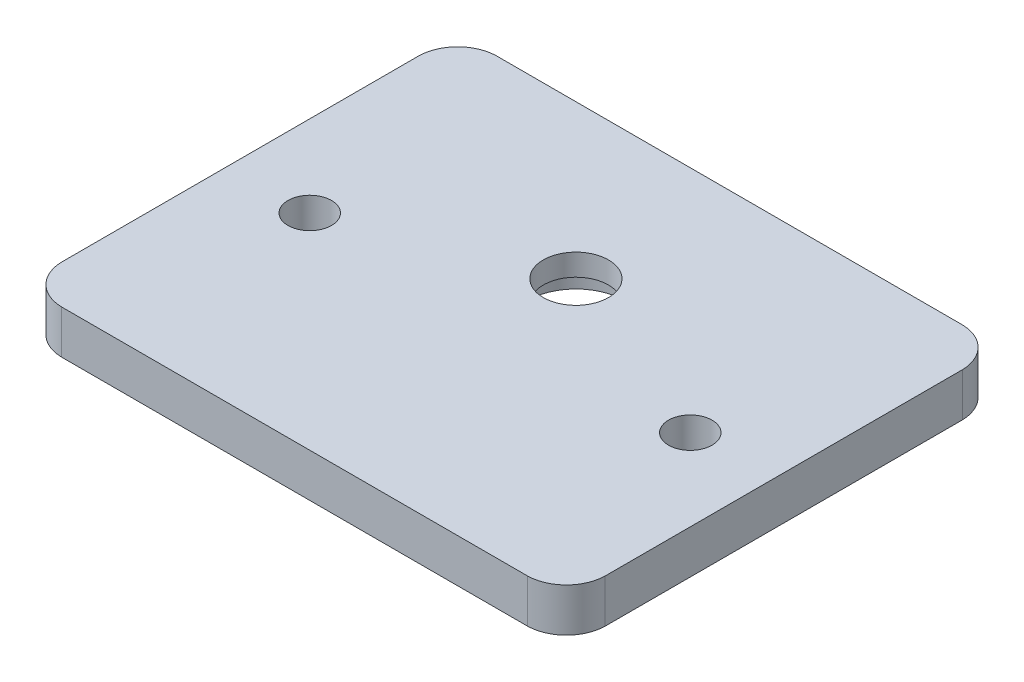
ISO-10303-21;
HEADER;
FILE_DESCRIPTION(('STEP AP214'),'2;1');
FILE_NAME('part.step','',(''),(''),'','','');
FILE_SCHEMA(('AUTOMOTIVE_DESIGN { 1 0 10303 214 1 1 1 1 }'));
ENDSEC;
DATA;
#1=APPLICATION_CONTEXT('core data for automotive mechanical design processes');
#2=APPLICATION_PROTOCOL_DEFINITION('international standard','automotive_design',2000,#1);
#3=PRODUCT_CONTEXT('',#1,'mechanical');
#4=PRODUCT('Part','Part','',(#3));
#5=PRODUCT_RELATED_PRODUCT_CATEGORY('part','',(#4));
#6=PRODUCT_DEFINITION_FORMATION('','',#4);
#7=PRODUCT_DEFINITION_CONTEXT('part definition',#1,'design');
#8=PRODUCT_DEFINITION('design','',#6,#7);
#9=PRODUCT_DEFINITION_SHAPE('','',#8);
#10=(LENGTH_UNIT() NAMED_UNIT(*) SI_UNIT(.MILLI.,.METRE.));
#11=(NAMED_UNIT(*) PLANE_ANGLE_UNIT() SI_UNIT($,.RADIAN.));
#12=(NAMED_UNIT(*) SI_UNIT($,.STERADIAN.) SOLID_ANGLE_UNIT());
#13=UNCERTAINTY_MEASURE_WITH_UNIT(LENGTH_MEASURE(1.E-05),#10,'distance_accuracy_value','');
#14=(GEOMETRIC_REPRESENTATION_CONTEXT(3) GLOBAL_UNCERTAINTY_ASSIGNED_CONTEXT((#13)) GLOBAL_UNIT_ASSIGNED_CONTEXT((#10,
#11,#12)) REPRESENTATION_CONTEXT('',''));
#15=CARTESIAN_POINT('',(0.,0.,0.));
#16=DIRECTION('',(0.,0.,1.));
#17=DIRECTION('',(1.,0.,0.));
#18=AXIS2_PLACEMENT_3D('',#15,#16,#17);
#19=CARTESIAN_POINT('',(21.3619626282644,4.,16.3619626282645));
#20=DIRECTION('',(0.,-1.,0.));
#21=DIRECTION('',(0.,0.,-1.));
#22=AXIS2_PLACEMENT_3D('',#19,#20,#21);
#23=CYLINDRICAL_SURFACE('',#22,3.63903046216359);
#24=CARTESIAN_POINT('',(21.3619626282644,0.,16.3619626282645));
#25=DIRECTION('',(0.,1.,0.));
#26=DIRECTION('',(0.,0.,1.));
#27=AXIS2_PLACEMENT_3D('',#24,#25,#26);
#28=CIRCLE('',#27,3.63903046216359);
#29=CARTESIAN_POINT('',(25.,0.,16.446973135908));
#30=VERTEX_POINT('',#29);
#31=CARTESIAN_POINT('',(21.4469731359103,0.,20.));
#32=VERTEX_POINT('',#31);
#33=EDGE_CURVE('E158',#30,#32,#28,.F.);
#34=ORIENTED_EDGE('',*,*,#33,.F.);
#35=DIRECTION('',(0.,-1.,0.));
#36=VECTOR('',#35,1.);
#37=CARTESIAN_POINT('',(25.,4.,16.446973135908));
#38=LINE('',#37,#36);
#39=CARTESIAN_POINT('',(25.,4.,16.446973135908));
#40=VERTEX_POINT('',#39);
#41=EDGE_CURVE('E11',#40,#30,#38,.T.);
#42=ORIENTED_EDGE('',*,*,#41,.F.);
#43=CARTESIAN_POINT('',(21.3619626282644,4.,16.3619626282645));
#44=DIRECTION('',(0.,1.,0.));
#45=DIRECTION('',(0.,0.,1.));
#46=AXIS2_PLACEMENT_3D('',#43,#44,#45);
#47=CIRCLE('',#46,3.63903046216359);
#48=CARTESIAN_POINT('',(21.4469731359103,4.,20.));
#49=VERTEX_POINT('',#48);
#50=EDGE_CURVE('E249',#40,#49,#47,.F.);
#51=ORIENTED_EDGE('',*,*,#50,.T.);
#52=DIRECTION('',(0.,-1.,0.));
#53=VECTOR('',#52,1.);
#54=CARTESIAN_POINT('',(21.4469731359103,4.,20.));
#55=LINE('',#54,#53);
#56=EDGE_CURVE('E87',#49,#32,#55,.T.);
#57=ORIENTED_EDGE('',*,*,#56,.T.);
#58=EDGE_LOOP('',(#34,#42,#51,#57));
#59=FACE_BOUND('',#58,.T.);
#60=ADVANCED_FACE('F35',(#59),#23,.T.);
#61=CARTESIAN_POINT('',(25.,4.,0.));
#62=DIRECTION('',(1.,0.,0.));
#63=DIRECTION('',(0.,0.,-1.));
#64=AXIS2_PLACEMENT_3D('',#61,#62,#63);
#65=PLANE('',#64);
#66=DIRECTION('',(0.,0.,1.));
#67=VECTOR('',#66,1.);
#68=CARTESIAN_POINT('',(25.,0.,0.));
#69=LINE('',#68,#67);
#70=CARTESIAN_POINT('',(25.,0.,-16.4469731359106));
#71=VERTEX_POINT('',#70);
#72=EDGE_CURVE('E152',#71,#30,#69,.T.);
#73=ORIENTED_EDGE('',*,*,#72,.F.);
#74=DIRECTION('',(0.,-1.,0.));
#75=VECTOR('',#74,1.);
#76=CARTESIAN_POINT('',(25.,4.,-16.4469731359106));
#77=LINE('',#76,#75);
#78=CARTESIAN_POINT('',(25.,4.,-16.4469731359106));
#79=VERTEX_POINT('',#78);
#80=EDGE_CURVE('E45',#79,#71,#77,.T.);
#81=ORIENTED_EDGE('',*,*,#80,.F.);
#82=DIRECTION('',(0.,0.,1.));
#83=VECTOR('',#82,1.);
#84=CARTESIAN_POINT('',(25.,4.,0.));
#85=LINE('',#84,#83);
#86=EDGE_CURVE('E251',#79,#40,#85,.T.);
#87=ORIENTED_EDGE('',*,*,#86,.T.);
#88=ORIENTED_EDGE('',*,*,#41,.T.);
#89=EDGE_LOOP('',(#73,#81,#87,#88));
#90=FACE_BOUND('',#89,.T.);
#91=ADVANCED_FACE('F157',(#90),#65,.T.);
#92=CARTESIAN_POINT('',(21.3619626282645,4.,-16.3619626282644));
#93=DIRECTION('',(0.,-1.,0.));
#94=DIRECTION('',(0.,0.,-1.));
#95=AXIS2_PLACEMENT_3D('',#92,#93,#94);
#96=CYLINDRICAL_SURFACE('',#95,3.63903046216359);
#97=CARTESIAN_POINT('',(21.3619626282645,0.,-16.3619626282644));
#98=DIRECTION('',(0.,1.,0.));
#99=DIRECTION('',(0.,0.,1.));
#100=AXIS2_PLACEMENT_3D('',#97,#98,#99);
#101=CIRCLE('',#100,3.63903046216359);
#102=CARTESIAN_POINT('',(21.446973135908,0.,-20.));
#103=VERTEX_POINT('',#102);
#104=EDGE_CURVE('E143',#71,#103,#101,.T.);
#105=ORIENTED_EDGE('',*,*,#104,.T.);
#106=DIRECTION('',(0.,-1.,0.));
#107=VECTOR('',#106,1.);
#108=CARTESIAN_POINT('',(21.446973135908,4.,-20.));
#109=LINE('',#108,#107);
#110=CARTESIAN_POINT('',(21.446973135908,4.,-20.));
#111=VERTEX_POINT('',#110);
#112=EDGE_CURVE('E135',#111,#103,#109,.T.);
#113=ORIENTED_EDGE('',*,*,#112,.F.);
#114=CARTESIAN_POINT('',(21.3619626282645,4.,-16.3619626282644));
#115=DIRECTION('',(0.,1.,0.));
#116=DIRECTION('',(0.,0.,1.));
#117=AXIS2_PLACEMENT_3D('',#114,#115,#116);
#118=CIRCLE('',#117,3.63903046216359);
#119=EDGE_CURVE('E145',#79,#111,#118,.T.);
#120=ORIENTED_EDGE('',*,*,#119,.F.);
#121=ORIENTED_EDGE('',*,*,#80,.T.);
#122=EDGE_LOOP('',(#105,#113,#120,#121));
#123=FACE_BOUND('',#122,.T.);
#124=ADVANCED_FACE('F141',(#123),#96,.T.);
#125=CARTESIAN_POINT('',(0.,4.,-20.));
#126=DIRECTION('',(0.,0.,-1.));
#127=DIRECTION('',(-1.,0.,0.));
#128=AXIS2_PLACEMENT_3D('',#125,#126,#127);
#129=PLANE('',#128);
#130=DIRECTION('',(1.,0.,0.));
#131=VECTOR('',#130,1.);
#132=CARTESIAN_POINT('',(0.,0.,-20.));
#133=LINE('',#132,#131);
#134=CARTESIAN_POINT('',(-21.4469731359094,0.,-20.));
#135=VERTEX_POINT('',#134);
#136=EDGE_CURVE('E155',#135,#103,#133,.T.);
#137=ORIENTED_EDGE('',*,*,#136,.F.);
#138=DIRECTION('',(0.,-1.,0.));
#139=VECTOR('',#138,1.);
#140=CARTESIAN_POINT('',(-21.4469731359094,4.,-20.));
#141=LINE('',#140,#139);
#142=CARTESIAN_POINT('',(-21.4469731359094,4.,-20.));
#143=VERTEX_POINT('',#142);
#144=EDGE_CURVE('E129',#143,#135,#141,.T.);
#145=ORIENTED_EDGE('',*,*,#144,.F.);
#146=DIRECTION('',(1.,0.,0.));
#147=VECTOR('',#146,1.);
#148=CARTESIAN_POINT('',(0.,4.,-20.));
#149=LINE('',#148,#147);
#150=EDGE_CURVE('E254',#143,#111,#149,.T.);
#151=ORIENTED_EDGE('',*,*,#150,.T.);
#152=ORIENTED_EDGE('',*,*,#112,.T.);
#153=EDGE_LOOP('',(#137,#145,#151,#152));
#154=FACE_BOUND('',#153,.T.);
#155=ADVANCED_FACE('F200',(#154),#129,.T.);
#156=CARTESIAN_POINT('',(-21.3619626282644,4.,-16.3619626282644));
#157=DIRECTION('',(0.,-1.,0.));
#158=DIRECTION('',(0.,0.,-1.));
#159=AXIS2_PLACEMENT_3D('',#156,#157,#158);
#160=CYLINDRICAL_SURFACE('',#159,3.63903046216359);
#161=CARTESIAN_POINT('',(-21.3619626282644,0.,-16.3619626282644));
#162=DIRECTION('',(0.,1.,0.));
#163=DIRECTION('',(0.,0.,1.));
#164=AXIS2_PLACEMENT_3D('',#161,#162,#163);
#165=CIRCLE('',#164,3.63903046216359);
#166=CARTESIAN_POINT('',(-25.,0.,-16.4469731359086));
#167=VERTEX_POINT('',#166);
#168=EDGE_CURVE('E165',#167,#135,#165,.F.);
#169=ORIENTED_EDGE('',*,*,#168,.F.);
#170=DIRECTION('',(0.,-1.,0.));
#171=VECTOR('',#170,1.);
#172=CARTESIAN_POINT('',(-25.,4.,-16.4469731359086));
#173=LINE('',#172,#171);
#174=CARTESIAN_POINT('',(-25.,4.,-16.4469731359086));
#175=VERTEX_POINT('',#174);
#176=EDGE_CURVE('E127',#175,#167,#173,.T.);
#177=ORIENTED_EDGE('',*,*,#176,.F.);
#178=CARTESIAN_POINT('',(-21.3619626282644,4.,-16.3619626282644));
#179=DIRECTION('',(0.,1.,0.));
#180=DIRECTION('',(0.,0.,1.));
#181=AXIS2_PLACEMENT_3D('',#178,#179,#180);
#182=CIRCLE('',#181,3.63903046216359);
#183=EDGE_CURVE('E121',#175,#143,#182,.F.);
#184=ORIENTED_EDGE('',*,*,#183,.T.);
#185=ORIENTED_EDGE('',*,*,#144,.T.);
#186=EDGE_LOOP('',(#169,#177,#184,#185));
#187=FACE_BOUND('',#186,.T.);
#188=ADVANCED_FACE('F203',(#187),#160,.T.);
#189=CARTESIAN_POINT('',(-25.,4.,0.));
#190=DIRECTION('',(1.,0.,0.));
#191=DIRECTION('',(0.,0.,-1.));
#192=AXIS2_PLACEMENT_3D('',#189,#190,#191);
#193=PLANE('',#192);
#194=DIRECTION('',(0.,0.,1.));
#195=VECTOR('',#194,1.);
#196=CARTESIAN_POINT('',(-25.,0.,0.));
#197=LINE('',#196,#195);
#198=CARTESIAN_POINT('',(-25.,0.,16.4469731359088));
#199=VERTEX_POINT('',#198);
#200=EDGE_CURVE('E126',#167,#199,#197,.T.);
#201=ORIENTED_EDGE('',*,*,#200,.T.);
#202=DIRECTION('',(0.,-1.,0.));
#203=VECTOR('',#202,1.);
#204=CARTESIAN_POINT('',(-25.,4.,16.4469731359088));
#205=LINE('',#204,#203);
#206=CARTESIAN_POINT('',(-25.,4.,16.4469731359088));
#207=VERTEX_POINT('',#206);
#208=EDGE_CURVE('E111',#207,#199,#205,.T.);
#209=ORIENTED_EDGE('',*,*,#208,.F.);
#210=DIRECTION('',(0.,0.,1.));
#211=VECTOR('',#210,1.);
#212=CARTESIAN_POINT('',(-25.,4.,0.));
#213=LINE('',#212,#211);
#214=EDGE_CURVE('E114',#175,#207,#213,.T.);
#215=ORIENTED_EDGE('',*,*,#214,.F.);
#216=ORIENTED_EDGE('',*,*,#176,.T.);
#217=EDGE_LOOP('',(#201,#209,#215,#216));
#218=FACE_BOUND('',#217,.T.);
#219=ADVANCED_FACE('F124',(#218),#193,.F.);
#220=CARTESIAN_POINT('',(-21.3619626282644,4.,16.3619626282644));
#221=DIRECTION('',(0.,-1.,0.));
#222=DIRECTION('',(0.,0.,-1.));
#223=AXIS2_PLACEMENT_3D('',#220,#221,#222);
#224=CYLINDRICAL_SURFACE('',#223,3.63903046216359);
#225=CARTESIAN_POINT('',(-21.3619626282644,0.,16.3619626282644));
#226=DIRECTION('',(0.,1.,0.));
#227=DIRECTION('',(0.,0.,1.));
#228=AXIS2_PLACEMENT_3D('',#225,#226,#227);
#229=CIRCLE('',#228,3.63903046216359);
#230=CARTESIAN_POINT('',(-21.4469731359088,0.,20.));
#231=VERTEX_POINT('',#230);
#232=EDGE_CURVE('E168',#199,#231,#229,.T.);
#233=ORIENTED_EDGE('',*,*,#232,.T.);
#234=DIRECTION('',(0.,-1.,0.));
#235=VECTOR('',#234,1.);
#236=CARTESIAN_POINT('',(-21.4469731359088,4.,20.));
#237=LINE('',#236,#235);
#238=CARTESIAN_POINT('',(-21.4469731359088,4.,20.));
#239=VERTEX_POINT('',#238);
#240=EDGE_CURVE('E113',#239,#231,#237,.T.);
#241=ORIENTED_EDGE('',*,*,#240,.F.);
#242=CARTESIAN_POINT('',(-21.3619626282644,4.,16.3619626282644));
#243=DIRECTION('',(0.,1.,0.));
#244=DIRECTION('',(0.,0.,1.));
#245=AXIS2_PLACEMENT_3D('',#242,#243,#244);
#246=CIRCLE('',#245,3.63903046216359);
#247=EDGE_CURVE('E106',#207,#239,#246,.T.);
#248=ORIENTED_EDGE('',*,*,#247,.F.);
#249=ORIENTED_EDGE('',*,*,#208,.T.);
#250=EDGE_LOOP('',(#233,#241,#248,#249));
#251=FACE_BOUND('',#250,.T.);
#252=ADVANCED_FACE('F109',(#251),#224,.T.);
#253=CARTESIAN_POINT('',(-17.5,4.,1.1026607347827));
#254=DIRECTION('',(0.,-1.,0.));
#255=DIRECTION('',(0.,0.,-1.));
#256=AXIS2_PLACEMENT_3D('',#253,#254,#255);
#257=CYLINDRICAL_SURFACE('',#256,2.);
#258=CARTESIAN_POINT('',(-17.5,4.,1.1026607347827));
#259=DIRECTION('',(0.,1.,0.));
#260=DIRECTION('',(0.,0.,1.));
#261=AXIS2_PLACEMENT_3D('',#258,#259,#260);
#262=CIRCLE('',#261,2.);
#263=CARTESIAN_POINT('',(-17.5,4.,3.1026607347827));
#264=VERTEX_POINT('',#263);
#265=EDGE_CURVE('E247',#264,#264,#262,.T.);
#266=ORIENTED_EDGE('',*,*,#265,.T.);
#267=EDGE_LOOP('',(#266));
#268=FACE_BOUND('',#267,.T.);
#269=CARTESIAN_POINT('',(-17.5,0.,1.1026607347827));
#270=DIRECTION('',(0.,1.,0.));
#271=DIRECTION('',(0.,0.,1.));
#272=AXIS2_PLACEMENT_3D('',#269,#270,#271);
#273=CIRCLE('',#272,2.);
#274=CARTESIAN_POINT('',(-17.5,0.,3.1026607347827));
#275=VERTEX_POINT('',#274);
#276=EDGE_CURVE('E160',#275,#275,#273,.T.);
#277=ORIENTED_EDGE('',*,*,#276,.F.);
#278=EDGE_LOOP('',(#277));
#279=FACE_BOUND('',#278,.T.);
#280=ADVANCED_FACE('F180',(#268,#279),#257,.F.);
#281=CARTESIAN_POINT('',(17.5,4.,1.10266073478268));
#282=DIRECTION('',(0.,-1.,0.));
#283=DIRECTION('',(0.,0.,-1.));
#284=AXIS2_PLACEMENT_3D('',#281,#282,#283);
#285=CYLINDRICAL_SURFACE('',#284,2.);
#286=CARTESIAN_POINT('',(17.5,4.,1.10266073478268));
#287=DIRECTION('',(0.,1.,0.));
#288=DIRECTION('',(0.,0.,1.));
#289=AXIS2_PLACEMENT_3D('',#286,#287,#288);
#290=CIRCLE('',#289,2.);
#291=CARTESIAN_POINT('',(17.5,4.,3.10266073478268));
#292=VERTEX_POINT('',#291);
#293=EDGE_CURVE('E170',#292,#292,#290,.T.);
#294=ORIENTED_EDGE('',*,*,#293,.T.);
#295=EDGE_LOOP('',(#294));
#296=FACE_BOUND('',#295,.T.);
#297=CARTESIAN_POINT('',(17.5,0.,1.10266073478268));
#298=DIRECTION('',(0.,1.,0.));
#299=DIRECTION('',(0.,0.,1.));
#300=AXIS2_PLACEMENT_3D('',#297,#298,#299);
#301=CIRCLE('',#300,2.);
#302=CARTESIAN_POINT('',(17.5,0.,3.10266073478268));
#303=VERTEX_POINT('',#302);
#304=EDGE_CURVE('E173',#303,#303,#301,.T.);
#305=ORIENTED_EDGE('',*,*,#304,.F.);
#306=EDGE_LOOP('',(#305));
#307=FACE_BOUND('',#306,.T.);
#308=ADVANCED_FACE('F37',(#296,#307),#285,.F.);
#309=CARTESIAN_POINT('',(0.,4.,20.));
#310=DIRECTION('',(0.,0.,-1.));
#311=DIRECTION('',(-1.,0.,0.));
#312=AXIS2_PLACEMENT_3D('',#309,#310,#311);
#313=PLANE('',#312);
#314=DIRECTION('',(1.,0.,0.));
#315=VECTOR('',#314,1.);
#316=CARTESIAN_POINT('',(0.,0.,20.));
#317=LINE('',#316,#315);
#318=EDGE_CURVE('E80',#231,#32,#317,.T.);
#319=ORIENTED_EDGE('',*,*,#318,.T.);
#320=ORIENTED_EDGE('',*,*,#56,.F.);
#321=DIRECTION('',(1.,0.,0.));
#322=VECTOR('',#321,1.);
#323=CARTESIAN_POINT('',(0.,4.,20.));
#324=LINE('',#323,#322);
#325=EDGE_CURVE('E53',#239,#49,#324,.T.);
#326=ORIENTED_EDGE('',*,*,#325,.F.);
#327=ORIENTED_EDGE('',*,*,#240,.T.);
#328=EDGE_LOOP('',(#319,#320,#326,#327));
#329=FACE_BOUND('',#328,.T.);
#330=ADVANCED_FACE('F187',(#329),#313,.F.);
#331=CARTESIAN_POINT('',(0.,4.,0.));
#332=DIRECTION('',(0.,1.,0.));
#333=DIRECTION('',(0.,0.,1.));
#334=AXIS2_PLACEMENT_3D('',#331,#332,#333);
#335=PLANE('',#334);
#336=CARTESIAN_POINT('',(-0.0216605122598766,4.,-5.89988269999999));
#337=DIRECTION('',(0.,1.,0.));
#338=DIRECTION('',(0.,0.,1.));
#339=AXIS2_PLACEMENT_3D('',#336,#337,#338);
#340=CIRCLE('',#339,3.);
#341=CARTESIAN_POINT('',(-0.0216605122598766,4.,-2.8998827));
#342=VERTEX_POINT('',#341);
#343=EDGE_CURVE('E175',#342,#342,#340,.T.);
#344=ORIENTED_EDGE('',*,*,#343,.F.);
#345=EDGE_LOOP('',(#344));
#346=FACE_BOUND('',#345,.T.);
#347=ORIENTED_EDGE('',*,*,#293,.F.);
#348=EDGE_LOOP('',(#347));
#349=FACE_BOUND('',#348,.T.);
#350=ORIENTED_EDGE('',*,*,#265,.F.);
#351=EDGE_LOOP('',(#350));
#352=FACE_BOUND('',#351,.T.);
#353=ORIENTED_EDGE('',*,*,#50,.F.);
#354=ORIENTED_EDGE('',*,*,#86,.F.);
#355=ORIENTED_EDGE('',*,*,#119,.T.);
#356=ORIENTED_EDGE('',*,*,#150,.F.);
#357=ORIENTED_EDGE('',*,*,#183,.F.);
#358=ORIENTED_EDGE('',*,*,#214,.T.);
#359=ORIENTED_EDGE('',*,*,#247,.T.);
#360=ORIENTED_EDGE('',*,*,#325,.T.);
#361=EDGE_LOOP('',(#353,#354,#355,#356,#357,#358,#359,#360));
#362=FACE_BOUND('',#361,.T.);
#363=ADVANCED_FACE('F118',(#346,#349,#352,#362),#335,.T.);
#364=CARTESIAN_POINT('',(0.,0.,0.));
#365=DIRECTION('',(0.,1.,0.));
#366=DIRECTION('',(0.,0.,1.));
#367=AXIS2_PLACEMENT_3D('',#364,#365,#366);
#368=PLANE('',#367);
#369=CARTESIAN_POINT('',(-0.0216605122598766,0.,-5.89988269999999));
#370=DIRECTION('',(0.,1.,0.));
#371=DIRECTION('',(0.,0.,1.));
#372=AXIS2_PLACEMENT_3D('',#369,#370,#371);
#373=CIRCLE('',#372,4.5);
#374=CARTESIAN_POINT('',(-0.0216605122598766,0.,-1.39988269999999));
#375=VERTEX_POINT('',#374);
#376=EDGE_CURVE('E238',#375,#375,#373,.T.);
#377=ORIENTED_EDGE('',*,*,#376,.T.);
#378=EDGE_LOOP('',(#377));
#379=FACE_BOUND('',#378,.T.);
#380=ORIENTED_EDGE('',*,*,#304,.T.);
#381=EDGE_LOOP('',(#380));
#382=FACE_BOUND('',#381,.T.);
#383=ORIENTED_EDGE('',*,*,#276,.T.);
#384=EDGE_LOOP('',(#383));
#385=FACE_BOUND('',#384,.T.);
#386=ORIENTED_EDGE('',*,*,#33,.T.);
#387=ORIENTED_EDGE('',*,*,#318,.F.);
#388=ORIENTED_EDGE('',*,*,#232,.F.);
#389=ORIENTED_EDGE('',*,*,#200,.F.);
#390=ORIENTED_EDGE('',*,*,#168,.T.);
#391=ORIENTED_EDGE('',*,*,#136,.T.);
#392=ORIENTED_EDGE('',*,*,#104,.F.);
#393=ORIENTED_EDGE('',*,*,#72,.T.);
#394=EDGE_LOOP('',(#386,#387,#388,#389,#390,#391,#392,#393));
#395=FACE_BOUND('',#394,.T.);
#396=ADVANCED_FACE('F151',(#379,#382,#385,#395),#368,.F.);
#397=CARTESIAN_POINT('',(-0.0216605122598766,4.,-5.89988269999999));
#398=DIRECTION('',(0.,-1.,0.));
#399=DIRECTION('',(0.,0.,-1.));
#400=AXIS2_PLACEMENT_3D('',#397,#398,#399);
#401=CYLINDRICAL_SURFACE('',#400,3.);
#402=CARTESIAN_POINT('',(-0.0216605122598766,2.,-5.89988269999999));
#403=DIRECTION('',(0.,1.,0.));
#404=DIRECTION('',(0.,0.,1.));
#405=AXIS2_PLACEMENT_3D('',#402,#403,#404);
#406=CIRCLE('',#405,3.);
#407=CARTESIAN_POINT('',(-0.0216605122598766,2.,-2.8998827));
#408=VERTEX_POINT('',#407);
#409=EDGE_CURVE('E39',#408,#408,#406,.T.);
#410=ORIENTED_EDGE('',*,*,#409,.F.);
#411=EDGE_LOOP('',(#410));
#412=FACE_BOUND('',#411,.T.);
#413=ORIENTED_EDGE('',*,*,#343,.T.);
#414=EDGE_LOOP('',(#413));
#415=FACE_BOUND('',#414,.T.);
#416=ADVANCED_FACE('F215',(#412,#415),#401,.F.);
#417=CARTESIAN_POINT('',(-0.0216605122598766,2.,-5.89988269999999));
#418=DIRECTION('',(0.,-1.,0.));
#419=DIRECTION('',(0.,0.,-1.));
#420=AXIS2_PLACEMENT_3D('',#417,#418,#419);
#421=CYLINDRICAL_SURFACE('',#420,4.5);
#422=CARTESIAN_POINT('',(-0.0216605122598766,2.,-5.89988269999999));
#423=DIRECTION('',(0.,1.,0.));
#424=DIRECTION('',(0.,0.,1.));
#425=AXIS2_PLACEMENT_3D('',#422,#423,#424);
#426=CIRCLE('',#425,4.5);
#427=CARTESIAN_POINT('',(-0.0216605122598766,2.,-1.39988269999999));
#428=VERTEX_POINT('',#427);
#429=EDGE_CURVE('E237',#428,#428,#426,.T.);
#430=ORIENTED_EDGE('',*,*,#429,.T.);
#431=EDGE_LOOP('',(#430));
#432=FACE_BOUND('',#431,.T.);
#433=ORIENTED_EDGE('',*,*,#376,.F.);
#434=EDGE_LOOP('',(#433));
#435=FACE_BOUND('',#434,.T.);
#436=ADVANCED_FACE('F222',(#432,#435),#421,.F.);
#437=CARTESIAN_POINT('',(-0.0216605122598766,2.,-5.89988269999999));
#438=DIRECTION('',(0.,1.,0.));
#439=DIRECTION('',(0.,0.,1.));
#440=AXIS2_PLACEMENT_3D('',#437,#438,#439);
#441=PLANE('',#440);
#442=ORIENTED_EDGE('',*,*,#409,.T.);
#443=EDGE_LOOP('',(#442));
#444=FACE_BOUND('',#443,.T.);
#445=ORIENTED_EDGE('',*,*,#429,.F.);
#446=EDGE_LOOP('',(#445));
#447=FACE_BOUND('',#446,.T.);
#448=ADVANCED_FACE('F226',(#444,#447),#441,.F.);
#449=CLOSED_SHELL('',(#60,#91,#124,#155,#188,#219,#252,#280,#308,#330,#363,#396,#416,#436,#448));
#450=MANIFOLD_SOLID_BREP('B2',#449);
#451=ADVANCED_BREP_SHAPE_REPRESENTATION('',(#18,#450),#14);
#452=SHAPE_DEFINITION_REPRESENTATION(#9,#451);
ENDSEC;
END-ISO-10303-21;
